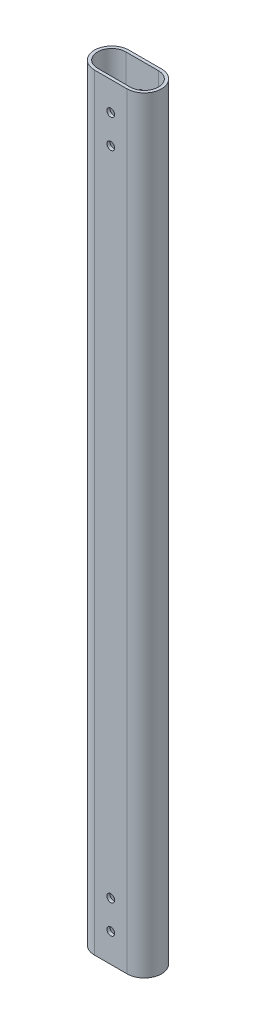
ISO-10303-21;
HEADER;
FILE_DESCRIPTION(('STEP AP214'),'2;1');
FILE_NAME('part.step','',(''),(''),'','','');
FILE_SCHEMA(('AUTOMOTIVE_DESIGN { 1 0 10303 214 1 1 1 1 }'));
ENDSEC;
DATA;
#1=APPLICATION_CONTEXT('core data for automotive mechanical design processes');
#2=APPLICATION_PROTOCOL_DEFINITION('international standard','automotive_design',2000,#1);
#3=PRODUCT_CONTEXT('',#1,'mechanical');
#4=PRODUCT('Part','Part','',(#3));
#5=PRODUCT_RELATED_PRODUCT_CATEGORY('part','',(#4));
#6=PRODUCT_DEFINITION_FORMATION('','',#4);
#7=PRODUCT_DEFINITION_CONTEXT('part definition',#1,'design');
#8=PRODUCT_DEFINITION('design','',#6,#7);
#9=PRODUCT_DEFINITION_SHAPE('','',#8);
#10=(LENGTH_UNIT() NAMED_UNIT(*) SI_UNIT(.MILLI.,.METRE.));
#11=(NAMED_UNIT(*) PLANE_ANGLE_UNIT() SI_UNIT($,.RADIAN.));
#12=(NAMED_UNIT(*) SI_UNIT($,.STERADIAN.) SOLID_ANGLE_UNIT());
#13=UNCERTAINTY_MEASURE_WITH_UNIT(LENGTH_MEASURE(1.E-05),#10,'distance_accuracy_value','');
#14=(GEOMETRIC_REPRESENTATION_CONTEXT(3) GLOBAL_UNCERTAINTY_ASSIGNED_CONTEXT((#13)) GLOBAL_UNIT_ASSIGNED_CONTEXT((#10,
#11,#12)) REPRESENTATION_CONTEXT('',''));
#15=CARTESIAN_POINT('',(0.,0.,0.));
#16=DIRECTION('',(0.,0.,1.));
#17=DIRECTION('',(1.,0.,0.));
#18=AXIS2_PLACEMENT_3D('',#15,#16,#17);
#19=CARTESIAN_POINT('',(-8.5,400.,0.));
#20=DIRECTION('',(0.,1.,0.));
#21=DIRECTION('',(0.,0.,1.));
#22=AXIS2_PLACEMENT_3D('',#19,#20,#21);
#23=PLANE('',#22);
#24=CARTESIAN_POINT('',(-8.5,400.,0.));
#25=DIRECTION('',(0.,1.,0.));
#26=DIRECTION('',(0.,0.,1.));
#27=AXIS2_PLACEMENT_3D('',#24,#25,#26);
#28=CIRCLE('',#27,9.);
#29=CARTESIAN_POINT('',(-8.5,400.,-8.99999999999999));
#30=VERTEX_POINT('',#29);
#31=CARTESIAN_POINT('',(-8.5,400.,9.00000000000001));
#32=VERTEX_POINT('',#31);
#33=EDGE_CURVE('E139',#30,#32,#28,.T.);
#34=ORIENTED_EDGE('',*,*,#33,.T.);
#35=DIRECTION('',(1.,0.,0.));
#36=VECTOR('',#35,1.);
#37=CARTESIAN_POINT('',(8.5,400.,9.));
#38=LINE('',#37,#36);
#39=CARTESIAN_POINT('',(8.5,400.,9.));
#40=VERTEX_POINT('',#39);
#41=EDGE_CURVE('E142',#32,#40,#38,.T.);
#42=ORIENTED_EDGE('',*,*,#41,.T.);
#43=CARTESIAN_POINT('',(8.5,400.,0.));
#44=DIRECTION('',(0.,1.,0.));
#45=DIRECTION('',(0.,0.,1.));
#46=AXIS2_PLACEMENT_3D('',#43,#44,#45);
#47=CIRCLE('',#46,9.);
#48=CARTESIAN_POINT('',(8.5,400.,-9.));
#49=VERTEX_POINT('',#48);
#50=EDGE_CURVE('E145',#40,#49,#47,.T.);
#51=ORIENTED_EDGE('',*,*,#50,.T.);
#52=DIRECTION('',(-1.,0.,0.));
#53=VECTOR('',#52,1.);
#54=CARTESIAN_POINT('',(8.5,400.,-9.));
#55=LINE('',#54,#53);
#56=EDGE_CURVE('E147',#49,#30,#55,.T.);
#57=ORIENTED_EDGE('',*,*,#56,.T.);
#58=EDGE_LOOP('',(#34,#42,#51,#57));
#59=FACE_BOUND('',#58,.T.);
#60=DIRECTION('',(-1.,0.,0.));
#61=VECTOR('',#60,1.);
#62=CARTESIAN_POINT('',(8.5,400.,-7.4));
#63=LINE('',#62,#61);
#64=CARTESIAN_POINT('',(8.5,400.,-7.4));
#65=VERTEX_POINT('',#64);
#66=CARTESIAN_POINT('',(-8.5,400.,-7.39999999999999));
#67=VERTEX_POINT('',#66);
#68=EDGE_CURVE('E109',#65,#67,#63,.T.);
#69=ORIENTED_EDGE('',*,*,#68,.F.);
#70=CARTESIAN_POINT('',(8.5,400.,0.));
#71=DIRECTION('',(0.,1.,0.));
#72=DIRECTION('',(0.,0.,1.));
#73=AXIS2_PLACEMENT_3D('',#70,#71,#72);
#74=CIRCLE('',#73,7.4);
#75=CARTESIAN_POINT('',(8.5,400.,7.4));
#76=VERTEX_POINT('',#75);
#77=EDGE_CURVE('E101',#76,#65,#74,.T.);
#78=ORIENTED_EDGE('',*,*,#77,.F.);
#79=DIRECTION('',(1.,0.,0.));
#80=VECTOR('',#79,1.);
#81=CARTESIAN_POINT('',(8.5,400.,7.4));
#82=LINE('',#81,#80);
#83=CARTESIAN_POINT('',(-8.5,400.,7.4));
#84=VERTEX_POINT('',#83);
#85=EDGE_CURVE('E123',#84,#76,#82,.T.);
#86=ORIENTED_EDGE('',*,*,#85,.F.);
#87=CARTESIAN_POINT('',(-8.5,400.,0.));
#88=DIRECTION('',(0.,1.,0.));
#89=DIRECTION('',(0.,0.,1.));
#90=AXIS2_PLACEMENT_3D('',#87,#88,#89);
#91=CIRCLE('',#90,7.4);
#92=EDGE_CURVE('E121',#67,#84,#91,.T.);
#93=ORIENTED_EDGE('',*,*,#92,.F.);
#94=EDGE_LOOP('',(#69,#78,#86,#93));
#95=FACE_BOUND('',#94,.T.);
#96=ADVANCED_FACE('F34',(#59,#95),#23,.T.);
#97=CARTESIAN_POINT('',(-8.5,0.,0.));
#98=DIRECTION('',(0.,1.,0.));
#99=DIRECTION('',(0.,0.,1.));
#100=AXIS2_PLACEMENT_3D('',#97,#98,#99);
#101=PLANE('',#100);
#102=CARTESIAN_POINT('',(-8.5,0.,0.));
#103=DIRECTION('',(0.,1.,0.));
#104=DIRECTION('',(0.,0.,1.));
#105=AXIS2_PLACEMENT_3D('',#102,#103,#104);
#106=CIRCLE('',#105,9.);
#107=CARTESIAN_POINT('',(-8.5,0.,-8.99999999999999));
#108=VERTEX_POINT('',#107);
#109=CARTESIAN_POINT('',(-8.5,0.,9.00000000000001));
#110=VERTEX_POINT('',#109);
#111=EDGE_CURVE('E117',#108,#110,#106,.T.);
#112=ORIENTED_EDGE('',*,*,#111,.F.);
#113=DIRECTION('',(-1.,0.,0.));
#114=VECTOR('',#113,1.);
#115=CARTESIAN_POINT('',(8.5,0.,-9.));
#116=LINE('',#115,#114);
#117=CARTESIAN_POINT('',(8.5,0.,-9.));
#118=VERTEX_POINT('',#117);
#119=EDGE_CURVE('E143',#118,#108,#116,.T.);
#120=ORIENTED_EDGE('',*,*,#119,.F.);
#121=CARTESIAN_POINT('',(8.5,0.,0.));
#122=DIRECTION('',(0.,1.,0.));
#123=DIRECTION('',(0.,0.,1.));
#124=AXIS2_PLACEMENT_3D('',#121,#122,#123);
#125=CIRCLE('',#124,9.);
#126=CARTESIAN_POINT('',(8.5,0.,9.));
#127=VERTEX_POINT('',#126);
#128=EDGE_CURVE('E154',#127,#118,#125,.T.);
#129=ORIENTED_EDGE('',*,*,#128,.F.);
#130=DIRECTION('',(1.,0.,0.));
#131=VECTOR('',#130,1.);
#132=CARTESIAN_POINT('',(8.5,0.,9.));
#133=LINE('',#132,#131);
#134=EDGE_CURVE('E152',#110,#127,#133,.T.);
#135=ORIENTED_EDGE('',*,*,#134,.F.);
#136=EDGE_LOOP('',(#112,#120,#129,#135));
#137=FACE_BOUND('',#136,.T.);
#138=CARTESIAN_POINT('',(8.5,0.,0.));
#139=DIRECTION('',(0.,1.,0.));
#140=DIRECTION('',(0.,0.,1.));
#141=AXIS2_PLACEMENT_3D('',#138,#139,#140);
#142=CIRCLE('',#141,7.4);
#143=CARTESIAN_POINT('',(8.5,0.,7.4));
#144=VERTEX_POINT('',#143);
#145=CARTESIAN_POINT('',(8.5,0.,-7.4));
#146=VERTEX_POINT('',#145);
#147=EDGE_CURVE('E59',#144,#146,#142,.T.);
#148=ORIENTED_EDGE('',*,*,#147,.T.);
#149=DIRECTION('',(-1.,0.,0.));
#150=VECTOR('',#149,1.);
#151=CARTESIAN_POINT('',(8.5,0.,-7.4));
#152=LINE('',#151,#150);
#153=CARTESIAN_POINT('',(-8.5,0.,-7.39999999999999));
#154=VERTEX_POINT('',#153);
#155=EDGE_CURVE('E116',#146,#154,#152,.T.);
#156=ORIENTED_EDGE('',*,*,#155,.T.);
#157=CARTESIAN_POINT('',(-8.5,0.,0.));
#158=DIRECTION('',(0.,1.,0.));
#159=DIRECTION('',(0.,0.,1.));
#160=AXIS2_PLACEMENT_3D('',#157,#158,#159);
#161=CIRCLE('',#160,7.4);
#162=CARTESIAN_POINT('',(-8.5,0.,7.4));
#163=VERTEX_POINT('',#162);
#164=EDGE_CURVE('E131',#154,#163,#161,.T.);
#165=ORIENTED_EDGE('',*,*,#164,.T.);
#166=DIRECTION('',(1.,0.,0.));
#167=VECTOR('',#166,1.);
#168=CARTESIAN_POINT('',(8.5,0.,7.4));
#169=LINE('',#168,#167);
#170=EDGE_CURVE('E110',#163,#144,#169,.T.);
#171=ORIENTED_EDGE('',*,*,#170,.T.);
#172=EDGE_LOOP('',(#148,#156,#165,#171));
#173=FACE_BOUND('',#172,.T.);
#174=ADVANCED_FACE('F223',(#137,#173),#101,.F.);
#175=CARTESIAN_POINT('',(-8.5,400.,0.));
#176=DIRECTION('',(0.,-1.,0.));
#177=DIRECTION('',(0.,0.,-1.));
#178=AXIS2_PLACEMENT_3D('',#175,#176,#177);
#179=CYLINDRICAL_SURFACE('',#178,9.);
#180=ORIENTED_EDGE('',*,*,#111,.T.);
#181=DIRECTION('',(0.,-1.,0.));
#182=VECTOR('',#181,1.);
#183=CARTESIAN_POINT('',(-8.5,400.,9.00000000000001));
#184=LINE('',#183,#182);
#185=EDGE_CURVE('E11',#32,#110,#184,.T.);
#186=ORIENTED_EDGE('',*,*,#185,.F.);
#187=ORIENTED_EDGE('',*,*,#33,.F.);
#188=DIRECTION('',(0.,-1.,0.));
#189=VECTOR('',#188,1.);
#190=CARTESIAN_POINT('',(-8.5,400.,-8.99999999999999));
#191=LINE('',#190,#189);
#192=EDGE_CURVE('E149',#30,#108,#191,.T.);
#193=ORIENTED_EDGE('',*,*,#192,.T.);
#194=EDGE_LOOP('',(#180,#186,#187,#193));
#195=FACE_BOUND('',#194,.T.);
#196=ADVANCED_FACE('F36',(#195),#179,.T.);
#197=CARTESIAN_POINT('',(8.5,400.,9.));
#198=DIRECTION('',(0.,0.,-1.));
#199=DIRECTION('',(-1.,0.,0.));
#200=AXIS2_PLACEMENT_3D('',#197,#198,#199);
#201=PLANE('',#200);
#202=CARTESIAN_POINT('',(0.,30.,9.00000000000001));
#203=DIRECTION('',(0.,0.,1.));
#204=DIRECTION('',(1.,0.,0.));
#205=AXIS2_PLACEMENT_3D('',#202,#203,#204);
#206=CIRCLE('',#205,2.01929999999999);
#207=CARTESIAN_POINT('',(2.01929999999999,30.,9.00000000000001));
#208=VERTEX_POINT('',#207);
#209=EDGE_CURVE('E248',#208,#208,#206,.T.);
#210=ORIENTED_EDGE('',*,*,#209,.F.);
#211=EDGE_LOOP('',(#210));
#212=FACE_BOUND('',#211,.T.);
#213=CARTESIAN_POINT('',(0.,15.,9.00000000000001));
#214=DIRECTION('',(0.,0.,1.));
#215=DIRECTION('',(1.,0.,0.));
#216=AXIS2_PLACEMENT_3D('',#213,#214,#215);
#217=CIRCLE('',#216,2.01929999999999);
#218=CARTESIAN_POINT('',(2.01929999999999,15.,9.00000000000001));
#219=VERTEX_POINT('',#218);
#220=EDGE_CURVE('E182',#219,#219,#217,.T.);
#221=ORIENTED_EDGE('',*,*,#220,.F.);
#222=EDGE_LOOP('',(#221));
#223=FACE_BOUND('',#222,.T.);
#224=CARTESIAN_POINT('',(0.,385.,9.00000000000001));
#225=DIRECTION('',(0.,0.,1.));
#226=DIRECTION('',(1.,0.,0.));
#227=AXIS2_PLACEMENT_3D('',#224,#225,#226);
#228=CIRCLE('',#227,2.01929999999999);
#229=CARTESIAN_POINT('',(2.01929999999999,385.,9.00000000000001));
#230=VERTEX_POINT('',#229);
#231=EDGE_CURVE('E179',#230,#230,#228,.T.);
#232=ORIENTED_EDGE('',*,*,#231,.F.);
#233=EDGE_LOOP('',(#232));
#234=FACE_BOUND('',#233,.T.);
#235=CARTESIAN_POINT('',(0.,370.,9.00000000000001));
#236=DIRECTION('',(0.,0.,1.));
#237=DIRECTION('',(1.,0.,0.));
#238=AXIS2_PLACEMENT_3D('',#235,#236,#237);
#239=CIRCLE('',#238,2.01929999999999);
#240=CARTESIAN_POINT('',(2.01929999999999,370.,9.00000000000001));
#241=VERTEX_POINT('',#240);
#242=EDGE_CURVE('E197',#241,#241,#239,.T.);
#243=ORIENTED_EDGE('',*,*,#242,.F.);
#244=EDGE_LOOP('',(#243));
#245=FACE_BOUND('',#244,.T.);
#246=ORIENTED_EDGE('',*,*,#134,.T.);
#247=DIRECTION('',(0.,-1.,0.));
#248=VECTOR('',#247,1.);
#249=CARTESIAN_POINT('',(8.5,400.,9.));
#250=LINE('',#249,#248);
#251=EDGE_CURVE('E43',#40,#127,#250,.T.);
#252=ORIENTED_EDGE('',*,*,#251,.F.);
#253=ORIENTED_EDGE('',*,*,#41,.F.);
#254=ORIENTED_EDGE('',*,*,#185,.T.);
#255=EDGE_LOOP('',(#246,#252,#253,#254));
#256=FACE_BOUND('',#255,.T.);
#257=ADVANCED_FACE('F237',(#212,#223,#234,#245,#256),#201,.F.);
#258=CARTESIAN_POINT('',(8.5,400.,0.));
#259=DIRECTION('',(0.,-1.,0.));
#260=DIRECTION('',(0.,0.,-1.));
#261=AXIS2_PLACEMENT_3D('',#258,#259,#260);
#262=CYLINDRICAL_SURFACE('',#261,9.);
#263=ORIENTED_EDGE('',*,*,#128,.T.);
#264=DIRECTION('',(0.,-1.,0.));
#265=VECTOR('',#264,1.);
#266=CARTESIAN_POINT('',(8.5,400.,-9.));
#267=LINE('',#266,#265);
#268=EDGE_CURVE('E159',#49,#118,#267,.T.);
#269=ORIENTED_EDGE('',*,*,#268,.F.);
#270=ORIENTED_EDGE('',*,*,#50,.F.);
#271=ORIENTED_EDGE('',*,*,#251,.T.);
#272=EDGE_LOOP('',(#263,#269,#270,#271));
#273=FACE_BOUND('',#272,.T.);
#274=ADVANCED_FACE('F234',(#273),#262,.T.);
#275=CARTESIAN_POINT('',(8.5,400.,-9.));
#276=DIRECTION('',(0.,0.,1.));
#277=DIRECTION('',(1.,0.,0.));
#278=AXIS2_PLACEMENT_3D('',#275,#276,#277);
#279=PLANE('',#278);
#280=CARTESIAN_POINT('',(0.,30.,-9.));
#281=DIRECTION('',(0.,0.,1.));
#282=DIRECTION('',(1.,0.,0.));
#283=AXIS2_PLACEMENT_3D('',#280,#281,#282);
#284=CIRCLE('',#283,2.0193);
#285=CARTESIAN_POINT('',(2.0193,30.,-9.));
#286=VERTEX_POINT('',#285);
#287=EDGE_CURVE('E301',#286,#286,#284,.T.);
#288=ORIENTED_EDGE('',*,*,#287,.T.);
#289=EDGE_LOOP('',(#288));
#290=FACE_BOUND('',#289,.T.);
#291=CARTESIAN_POINT('',(0.,15.,-9.));
#292=DIRECTION('',(0.,0.,1.));
#293=DIRECTION('',(1.,0.,0.));
#294=AXIS2_PLACEMENT_3D('',#291,#292,#293);
#295=CIRCLE('',#294,2.0193);
#296=CARTESIAN_POINT('',(2.0193,15.,-9.));
#297=VERTEX_POINT('',#296);
#298=EDGE_CURVE('E175',#297,#297,#295,.T.);
#299=ORIENTED_EDGE('',*,*,#298,.T.);
#300=EDGE_LOOP('',(#299));
#301=FACE_BOUND('',#300,.T.);
#302=CARTESIAN_POINT('',(0.,385.,-9.));
#303=DIRECTION('',(0.,0.,1.));
#304=DIRECTION('',(1.,0.,0.));
#305=AXIS2_PLACEMENT_3D('',#302,#303,#304);
#306=CIRCLE('',#305,2.0193);
#307=CARTESIAN_POINT('',(2.0193,385.,-9.));
#308=VERTEX_POINT('',#307);
#309=EDGE_CURVE('E171',#308,#308,#306,.T.);
#310=ORIENTED_EDGE('',*,*,#309,.T.);
#311=EDGE_LOOP('',(#310));
#312=FACE_BOUND('',#311,.T.);
#313=CARTESIAN_POINT('',(0.,370.,-9.));
#314=DIRECTION('',(0.,0.,1.));
#315=DIRECTION('',(1.,0.,0.));
#316=AXIS2_PLACEMENT_3D('',#313,#314,#315);
#317=CIRCLE('',#316,2.0193);
#318=CARTESIAN_POINT('',(2.0193,370.,-9.));
#319=VERTEX_POINT('',#318);
#320=EDGE_CURVE('E167',#319,#319,#317,.T.);
#321=ORIENTED_EDGE('',*,*,#320,.T.);
#322=EDGE_LOOP('',(#321));
#323=FACE_BOUND('',#322,.T.);
#324=ORIENTED_EDGE('',*,*,#119,.T.);
#325=ORIENTED_EDGE('',*,*,#192,.F.);
#326=ORIENTED_EDGE('',*,*,#56,.F.);
#327=ORIENTED_EDGE('',*,*,#268,.T.);
#328=EDGE_LOOP('',(#324,#325,#326,#327));
#329=FACE_BOUND('',#328,.T.);
#330=ADVANCED_FACE('F218',(#290,#301,#312,#323,#329),#279,.F.);
#331=CARTESIAN_POINT('',(8.5,400.,0.));
#332=DIRECTION('',(0.,-1.,0.));
#333=DIRECTION('',(0.,0.,-1.));
#334=AXIS2_PLACEMENT_3D('',#331,#332,#333);
#335=CYLINDRICAL_SURFACE('',#334,7.4);
#336=ORIENTED_EDGE('',*,*,#147,.F.);
#337=DIRECTION('',(0.,-1.,0.));
#338=VECTOR('',#337,1.);
#339=CARTESIAN_POINT('',(8.5,400.,7.4));
#340=LINE('',#339,#338);
#341=EDGE_CURVE('E105',#76,#144,#340,.T.);
#342=ORIENTED_EDGE('',*,*,#341,.F.);
#343=ORIENTED_EDGE('',*,*,#77,.T.);
#344=DIRECTION('',(0.,-1.,0.));
#345=VECTOR('',#344,1.);
#346=CARTESIAN_POINT('',(8.5,400.,-7.4));
#347=LINE('',#346,#345);
#348=EDGE_CURVE('E104',#65,#146,#347,.T.);
#349=ORIENTED_EDGE('',*,*,#348,.T.);
#350=EDGE_LOOP('',(#336,#342,#343,#349));
#351=FACE_BOUND('',#350,.T.);
#352=ADVANCED_FACE('F103',(#351),#335,.F.);
#353=CARTESIAN_POINT('',(8.5,400.,-7.4));
#354=DIRECTION('',(0.,0.,1.));
#355=DIRECTION('',(1.,0.,0.));
#356=AXIS2_PLACEMENT_3D('',#353,#354,#355);
#357=PLANE('',#356);
#358=CARTESIAN_POINT('',(0.,30.,-7.4));
#359=DIRECTION('',(0.,0.,1.));
#360=DIRECTION('',(1.,0.,0.));
#361=AXIS2_PLACEMENT_3D('',#358,#359,#360);
#362=CIRCLE('',#361,2.01929999999999);
#363=CARTESIAN_POINT('',(2.01929999999999,30.,-7.4));
#364=VERTEX_POINT('',#363);
#365=EDGE_CURVE('E187',#364,#364,#362,.T.);
#366=ORIENTED_EDGE('',*,*,#365,.F.);
#367=EDGE_LOOP('',(#366));
#368=FACE_BOUND('',#367,.T.);
#369=CARTESIAN_POINT('',(0.,15.,-7.4));
#370=DIRECTION('',(0.,0.,1.));
#371=DIRECTION('',(1.,0.,0.));
#372=AXIS2_PLACEMENT_3D('',#369,#370,#371);
#373=CIRCLE('',#372,2.01929999999999);
#374=CARTESIAN_POINT('',(2.01929999999999,15.,-7.4));
#375=VERTEX_POINT('',#374);
#376=EDGE_CURVE('E174',#375,#375,#373,.T.);
#377=ORIENTED_EDGE('',*,*,#376,.F.);
#378=EDGE_LOOP('',(#377));
#379=FACE_BOUND('',#378,.T.);
#380=CARTESIAN_POINT('',(0.,385.,-7.4));
#381=DIRECTION('',(0.,0.,1.));
#382=DIRECTION('',(1.,0.,0.));
#383=AXIS2_PLACEMENT_3D('',#380,#381,#382);
#384=CIRCLE('',#383,2.01929999999999);
#385=CARTESIAN_POINT('',(2.01929999999999,385.,-7.4));
#386=VERTEX_POINT('',#385);
#387=EDGE_CURVE('E170',#386,#386,#384,.T.);
#388=ORIENTED_EDGE('',*,*,#387,.F.);
#389=EDGE_LOOP('',(#388));
#390=FACE_BOUND('',#389,.T.);
#391=CARTESIAN_POINT('',(0.,370.,-7.4));
#392=DIRECTION('',(0.,0.,1.));
#393=DIRECTION('',(1.,0.,0.));
#394=AXIS2_PLACEMENT_3D('',#391,#392,#393);
#395=CIRCLE('',#394,2.01929999999999);
#396=CARTESIAN_POINT('',(2.01929999999999,370.,-7.4));
#397=VERTEX_POINT('',#396);
#398=EDGE_CURVE('E129',#397,#397,#395,.T.);
#399=ORIENTED_EDGE('',*,*,#398,.F.);
#400=EDGE_LOOP('',(#399));
#401=FACE_BOUND('',#400,.T.);
#402=ORIENTED_EDGE('',*,*,#155,.F.);
#403=ORIENTED_EDGE('',*,*,#348,.F.);
#404=ORIENTED_EDGE('',*,*,#68,.T.);
#405=DIRECTION('',(0.,-1.,0.));
#406=VECTOR('',#405,1.);
#407=CARTESIAN_POINT('',(-8.5,400.,-7.39999999999999));
#408=LINE('',#407,#406);
#409=EDGE_CURVE('E118',#67,#154,#408,.T.);
#410=ORIENTED_EDGE('',*,*,#409,.T.);
#411=EDGE_LOOP('',(#402,#403,#404,#410));
#412=FACE_BOUND('',#411,.T.);
#413=ADVANCED_FACE('F113',(#368,#379,#390,#401,#412),#357,.T.);
#414=CARTESIAN_POINT('',(-8.5,400.,0.));
#415=DIRECTION('',(0.,-1.,0.));
#416=DIRECTION('',(0.,0.,-1.));
#417=AXIS2_PLACEMENT_3D('',#414,#415,#416);
#418=CYLINDRICAL_SURFACE('',#417,7.4);
#419=ORIENTED_EDGE('',*,*,#164,.F.);
#420=ORIENTED_EDGE('',*,*,#409,.F.);
#421=ORIENTED_EDGE('',*,*,#92,.T.);
#422=DIRECTION('',(0.,-1.,0.));
#423=VECTOR('',#422,1.);
#424=CARTESIAN_POINT('',(-8.5,400.,7.4));
#425=LINE('',#424,#423);
#426=EDGE_CURVE('E51',#84,#163,#425,.T.);
#427=ORIENTED_EDGE('',*,*,#426,.T.);
#428=EDGE_LOOP('',(#419,#420,#421,#427));
#429=FACE_BOUND('',#428,.T.);
#430=ADVANCED_FACE('F208',(#429),#418,.F.);
#431=CARTESIAN_POINT('',(8.5,400.,7.4));
#432=DIRECTION('',(0.,0.,-1.));
#433=DIRECTION('',(-1.,0.,0.));
#434=AXIS2_PLACEMENT_3D('',#431,#432,#433);
#435=PLANE('',#434);
#436=CARTESIAN_POINT('',(0.,30.,7.4));
#437=DIRECTION('',(0.,0.,-1.));
#438=DIRECTION('',(-1.,0.,0.));
#439=AXIS2_PLACEMENT_3D('',#436,#437,#438);
#440=CIRCLE('',#439,2.01929999999999);
#441=CARTESIAN_POINT('',(-2.01929999999999,30.,7.4));
#442=VERTEX_POINT('',#441);
#443=EDGE_CURVE('E38',#442,#442,#440,.T.);
#444=ORIENTED_EDGE('',*,*,#443,.F.);
#445=EDGE_LOOP('',(#444));
#446=FACE_BOUND('',#445,.T.);
#447=CARTESIAN_POINT('',(0.,15.,7.4));
#448=DIRECTION('',(0.,0.,-1.));
#449=DIRECTION('',(-1.,0.,0.));
#450=AXIS2_PLACEMENT_3D('',#447,#448,#449);
#451=CIRCLE('',#450,2.01929999999999);
#452=CARTESIAN_POINT('',(-2.01929999999999,15.,7.4));
#453=VERTEX_POINT('',#452);
#454=EDGE_CURVE('E172',#453,#453,#451,.T.);
#455=ORIENTED_EDGE('',*,*,#454,.F.);
#456=EDGE_LOOP('',(#455));
#457=FACE_BOUND('',#456,.T.);
#458=CARTESIAN_POINT('',(0.,385.,7.4));
#459=DIRECTION('',(0.,0.,-1.));
#460=DIRECTION('',(-1.,0.,0.));
#461=AXIS2_PLACEMENT_3D('',#458,#459,#460);
#462=CIRCLE('',#461,2.01929999999999);
#463=CARTESIAN_POINT('',(-2.01929999999999,385.,7.4));
#464=VERTEX_POINT('',#463);
#465=EDGE_CURVE('E168',#464,#464,#462,.T.);
#466=ORIENTED_EDGE('',*,*,#465,.F.);
#467=EDGE_LOOP('',(#466));
#468=FACE_BOUND('',#467,.T.);
#469=CARTESIAN_POINT('',(0.,370.,7.4));
#470=DIRECTION('',(0.,0.,-1.));
#471=DIRECTION('',(-1.,0.,0.));
#472=AXIS2_PLACEMENT_3D('',#469,#470,#471);
#473=CIRCLE('',#472,2.01929999999999);
#474=CARTESIAN_POINT('',(-2.01929999999999,370.,7.4));
#475=VERTEX_POINT('',#474);
#476=EDGE_CURVE('E164',#475,#475,#473,.T.);
#477=ORIENTED_EDGE('',*,*,#476,.F.);
#478=EDGE_LOOP('',(#477));
#479=FACE_BOUND('',#478,.T.);
#480=ORIENTED_EDGE('',*,*,#170,.F.);
#481=ORIENTED_EDGE('',*,*,#426,.F.);
#482=ORIENTED_EDGE('',*,*,#85,.T.);
#483=ORIENTED_EDGE('',*,*,#341,.T.);
#484=EDGE_LOOP('',(#480,#481,#482,#483));
#485=FACE_BOUND('',#484,.T.);
#486=ADVANCED_FACE('F215',(#446,#457,#468,#479,#485),#435,.T.);
#487=CARTESIAN_POINT('',(0.,370.,9.));
#488=DIRECTION('',(0.,0.,1.));
#489=DIRECTION('',(1.,0.,0.));
#490=AXIS2_PLACEMENT_3D('',#487,#488,#489);
#491=CYLINDRICAL_SURFACE('',#490,2.01929999999999);
#492=ORIENTED_EDGE('',*,*,#476,.T.);
#493=EDGE_LOOP('',(#492));
#494=FACE_BOUND('',#493,.T.);
#495=ORIENTED_EDGE('',*,*,#242,.T.);
#496=EDGE_LOOP('',(#495));
#497=FACE_BOUND('',#496,.T.);
#498=ADVANCED_FACE('F269',(#494,#497),#491,.F.);
#499=ORIENTED_EDGE('',*,*,#398,.T.);
#500=EDGE_LOOP('',(#499));
#501=FACE_BOUND('',#500,.T.);
#502=ORIENTED_EDGE('',*,*,#320,.F.);
#503=EDGE_LOOP('',(#502));
#504=FACE_BOUND('',#503,.T.);
#505=ADVANCED_FACE('F204',(#501,#504),#491,.F.);
#506=CARTESIAN_POINT('',(0.,385.,9.));
#507=DIRECTION('',(0.,0.,1.));
#508=DIRECTION('',(1.,0.,0.));
#509=AXIS2_PLACEMENT_3D('',#506,#507,#508);
#510=CYLINDRICAL_SURFACE('',#509,2.01929999999999);
#511=ORIENTED_EDGE('',*,*,#465,.T.);
#512=EDGE_LOOP('',(#511));
#513=FACE_BOUND('',#512,.T.);
#514=ORIENTED_EDGE('',*,*,#231,.T.);
#515=EDGE_LOOP('',(#514));
#516=FACE_BOUND('',#515,.T.);
#517=ADVANCED_FACE('F280',(#513,#516),#510,.F.);
#518=ORIENTED_EDGE('',*,*,#387,.T.);
#519=EDGE_LOOP('',(#518));
#520=FACE_BOUND('',#519,.T.);
#521=ORIENTED_EDGE('',*,*,#309,.F.);
#522=EDGE_LOOP('',(#521));
#523=FACE_BOUND('',#522,.T.);
#524=ADVANCED_FACE('F283',(#520,#523),#510,.F.);
#525=CARTESIAN_POINT('',(0.,15.,9.));
#526=DIRECTION('',(0.,0.,1.));
#527=DIRECTION('',(1.,0.,0.));
#528=AXIS2_PLACEMENT_3D('',#525,#526,#527);
#529=CYLINDRICAL_SURFACE('',#528,2.01929999999999);
#530=ORIENTED_EDGE('',*,*,#454,.T.);
#531=EDGE_LOOP('',(#530));
#532=FACE_BOUND('',#531,.T.);
#533=ORIENTED_EDGE('',*,*,#220,.T.);
#534=EDGE_LOOP('',(#533));
#535=FACE_BOUND('',#534,.T.);
#536=ADVANCED_FACE('F285',(#532,#535),#529,.F.);
#537=ORIENTED_EDGE('',*,*,#376,.T.);
#538=EDGE_LOOP('',(#537));
#539=FACE_BOUND('',#538,.T.);
#540=ORIENTED_EDGE('',*,*,#298,.F.);
#541=EDGE_LOOP('',(#540));
#542=FACE_BOUND('',#541,.T.);
#543=ADVANCED_FACE('F288',(#539,#542),#529,.F.);
#544=CARTESIAN_POINT('',(0.,30.,9.));
#545=DIRECTION('',(0.,0.,1.));
#546=DIRECTION('',(1.,0.,0.));
#547=AXIS2_PLACEMENT_3D('',#544,#545,#546);
#548=CYLINDRICAL_SURFACE('',#547,2.01929999999999);
#549=ORIENTED_EDGE('',*,*,#443,.T.);
#550=EDGE_LOOP('',(#549));
#551=FACE_BOUND('',#550,.T.);
#552=ORIENTED_EDGE('',*,*,#209,.T.);
#553=EDGE_LOOP('',(#552));
#554=FACE_BOUND('',#553,.T.);
#555=ADVANCED_FACE('F289',(#551,#554),#548,.F.);
#556=ORIENTED_EDGE('',*,*,#365,.T.);
#557=EDGE_LOOP('',(#556));
#558=FACE_BOUND('',#557,.T.);
#559=ORIENTED_EDGE('',*,*,#287,.F.);
#560=EDGE_LOOP('',(#559));
#561=FACE_BOUND('',#560,.T.);
#562=ADVANCED_FACE('F291',(#558,#561),#548,.F.);
#563=CLOSED_SHELL('',(#96,#174,#196,#257,#274,#330,#352,#413,#430,#486,#498,#505,#517,#524,#536,
#543,#555,#562));
#564=MANIFOLD_SOLID_BREP('B2',#563);
#565=ADVANCED_BREP_SHAPE_REPRESENTATION('',(#18,#564),#14);
#566=SHAPE_DEFINITION_REPRESENTATION(#9,#565);
ENDSEC;
END-ISO-10303-21;
